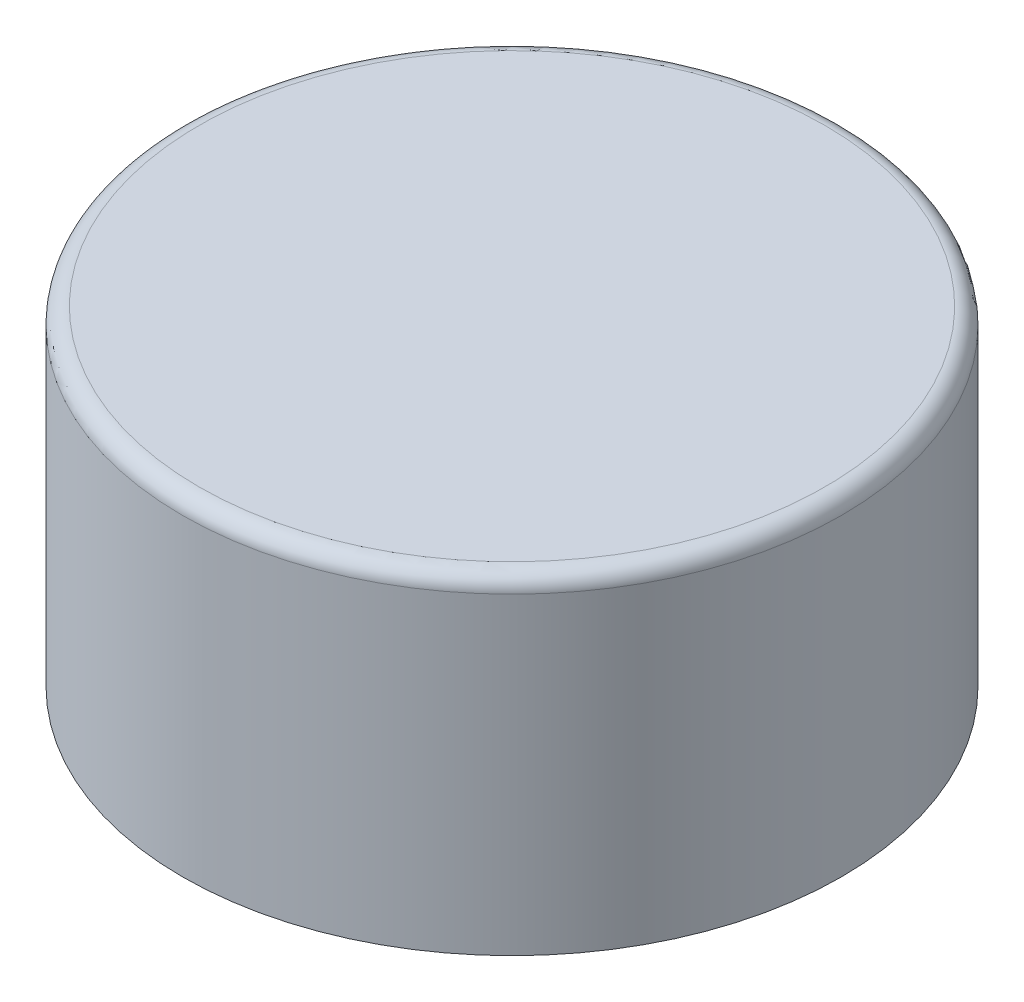
ISO-10303-21;
HEADER;
FILE_DESCRIPTION(('STEP AP214'),'2;1');
FILE_NAME('part.step','',(''),(''),'','','');
FILE_SCHEMA(('AUTOMOTIVE_DESIGN { 1 0 10303 214 1 1 1 1 }'));
ENDSEC;
DATA;
#1=APPLICATION_CONTEXT('core data for automotive mechanical design processes');
#2=APPLICATION_PROTOCOL_DEFINITION('international standard','automotive_design',2000,#1);
#3=PRODUCT_CONTEXT('',#1,'mechanical');
#4=PRODUCT('Part','Part','',(#3));
#5=PRODUCT_RELATED_PRODUCT_CATEGORY('part','',(#4));
#6=PRODUCT_DEFINITION_FORMATION('','',#4);
#7=PRODUCT_DEFINITION_CONTEXT('part definition',#1,'design');
#8=PRODUCT_DEFINITION('design','',#6,#7);
#9=PRODUCT_DEFINITION_SHAPE('','',#8);
#10=(LENGTH_UNIT() NAMED_UNIT(*) SI_UNIT(.MILLI.,.METRE.));
#11=(NAMED_UNIT(*) PLANE_ANGLE_UNIT() SI_UNIT($,.RADIAN.));
#12=(NAMED_UNIT(*) SI_UNIT($,.STERADIAN.) SOLID_ANGLE_UNIT());
#13=UNCERTAINTY_MEASURE_WITH_UNIT(LENGTH_MEASURE(1.E-05),#10,'distance_accuracy_value','');
#14=(GEOMETRIC_REPRESENTATION_CONTEXT(3) GLOBAL_UNCERTAINTY_ASSIGNED_CONTEXT((#13)) GLOBAL_UNIT_ASSIGNED_CONTEXT((#10,
#11,#12)) REPRESENTATION_CONTEXT('',''));
#15=CARTESIAN_POINT('',(0.,0.,0.));
#16=DIRECTION('',(0.,0.,1.));
#17=DIRECTION('',(1.,0.,0.));
#18=AXIS2_PLACEMENT_3D('',#15,#16,#17);
#19=CARTESIAN_POINT('',(0.,-20.,0.));
#20=DIRECTION('',(0.,1.,0.));
#21=DIRECTION('',(0.,0.,1.));
#22=AXIS2_PLACEMENT_3D('',#19,#20,#21);
#23=PLANE('',#22);
#24=CARTESIAN_POINT('',(0.,-20.,0.));
#25=DIRECTION('',(0.,1.,0.));
#26=DIRECTION('',(0.,0.,1.));
#27=AXIS2_PLACEMENT_3D('',#24,#25,#26);
#28=CIRCLE('',#27,40.);
#29=CARTESIAN_POINT('',(0.,-20.,40.));
#30=VERTEX_POINT('',#29);
#31=EDGE_CURVE('E68',#30,#30,#28,.T.);
#32=ORIENTED_EDGE('',*,*,#31,.F.);
#33=EDGE_LOOP('',(#32));
#34=FACE_BOUND('',#33,.T.);
#35=CARTESIAN_POINT('',(0.,-20.,0.));
#36=DIRECTION('',(0.,1.,0.));
#37=DIRECTION('',(0.,0.,1.));
#38=AXIS2_PLACEMENT_3D('',#35,#36,#37);
#39=CIRCLE('',#38,9.75);
#40=CARTESIAN_POINT('',(0.,-20.,-9.75));
#41=VERTEX_POINT('',#40);
#42=EDGE_CURVE('E12',#41,#41,#39,.T.);
#43=ORIENTED_EDGE('',*,*,#42,.T.);
#44=EDGE_LOOP('',(#43));
#45=FACE_BOUND('',#44,.T.);
#46=ADVANCED_FACE('F50',(#34,#45),#23,.F.);
#47=CARTESIAN_POINT('',(0.,20.,0.));
#48=DIRECTION('',(0.,-1.,0.));
#49=DIRECTION('',(0.,0.,-1.));
#50=AXIS2_PLACEMENT_3D('',#47,#48,#49);
#51=CYLINDRICAL_SURFACE('',#50,40.);
#52=CARTESIAN_POINT('',(0.,18.,0.));
#53=DIRECTION('',(0.,1.,0.));
#54=DIRECTION('',(0.,0.,1.));
#55=AXIS2_PLACEMENT_3D('',#52,#53,#54);
#56=CIRCLE('',#55,40.);
#57=CARTESIAN_POINT('',(0.,18.,40.));
#58=VERTEX_POINT('',#57);
#59=EDGE_CURVE('E81',#58,#58,#56,.F.);
#60=ORIENTED_EDGE('',*,*,#59,.T.);
#61=EDGE_LOOP('',(#60));
#62=FACE_BOUND('',#61,.T.);
#63=ORIENTED_EDGE('',*,*,#31,.T.);
#64=EDGE_LOOP('',(#63));
#65=FACE_BOUND('',#64,.T.);
#66=ADVANCED_FACE('F94',(#62,#65),#51,.T.);
#67=CARTESIAN_POINT('',(0.,20.,0.));
#68=DIRECTION('',(0.,1.,0.));
#69=DIRECTION('',(0.,0.,1.));
#70=AXIS2_PLACEMENT_3D('',#67,#68,#69);
#71=PLANE('',#70);
#72=CARTESIAN_POINT('',(0.,20.,0.));
#73=DIRECTION('',(0.,1.,0.));
#74=DIRECTION('',(0.,0.,1.));
#75=AXIS2_PLACEMENT_3D('',#72,#73,#74);
#76=CIRCLE('',#75,38.);
#77=CARTESIAN_POINT('',(0.,20.,38.));
#78=VERTEX_POINT('',#77);
#79=EDGE_CURVE('E72',#78,#78,#76,.T.);
#80=ORIENTED_EDGE('',*,*,#79,.T.);
#81=EDGE_LOOP('',(#80));
#82=FACE_BOUND('',#81,.T.);
#83=ADVANCED_FACE('F99',(#82),#71,.T.);
#84=CARTESIAN_POINT('',(0.,18.,0.));
#85=DIRECTION('',(0.,1.,0.));
#86=DIRECTION('',(0.,0.,1.));
#87=AXIS2_PLACEMENT_3D('',#84,#85,#86);
#88=TOROIDAL_SURFACE('',#87,38.,2.);
#89=ORIENTED_EDGE('',*,*,#59,.F.);
#90=EDGE_LOOP('',(#89));
#91=FACE_BOUND('',#90,.T.);
#92=ORIENTED_EDGE('',*,*,#79,.F.);
#93=EDGE_LOOP('',(#92));
#94=FACE_BOUND('',#93,.T.);
#95=ADVANCED_FACE('F52',(#91,#94),#88,.T.);
#96=CARTESIAN_POINT('',(0.,-20.,0.));
#97=DIRECTION('',(0.,-1.,0.));
#98=DIRECTION('',(0.,0.,-1.));
#99=AXIS2_PLACEMENT_3D('',#96,#97,#98);
#100=TOROIDAL_SURFACE('',#99,9.,0.750000000000001);
#101=CARTESIAN_POINT('',(0.,-20.,-9.));
#102=DIRECTION('',(1.,0.,0.));
#103=DIRECTION('',(0.,1.,0.));
#104=AXIS2_PLACEMENT_3D('',#101,#102,#103);
#105=CIRCLE('',#104,0.750000000000001);
#106=CARTESIAN_POINT('',(0.,-20.,-8.25));
#107=VERTEX_POINT('',#106);
#108=EDGE_CURVE('E65',#41,#107,#105,.T.);
#109=ORIENTED_EDGE('',*,*,#108,.T.);
#110=CARTESIAN_POINT('',(0.,-20.,0.));
#111=DIRECTION('',(0.,-1.,0.));
#112=DIRECTION('',(0.,0.,-1.));
#113=AXIS2_PLACEMENT_3D('',#110,#111,#112);
#114=CIRCLE('',#113,8.25);
#115=EDGE_CURVE('E58',#107,#107,#114,.T.);
#116=ORIENTED_EDGE('',*,*,#115,.F.);
#117=ORIENTED_EDGE('',*,*,#108,.F.);
#118=ORIENTED_EDGE('',*,*,#42,.F.);
#119=EDGE_LOOP('',(#109,#116,#117,#118));
#120=FACE_BOUND('',#119,.T.);
#121=ADVANCED_FACE('F66',(#120),#100,.F.);
#122=ORIENTED_EDGE('',*,*,#115,.T.);
#123=EDGE_LOOP('',(#122));
#124=FACE_BOUND('',#123,.T.);
#125=ADVANCED_FACE('F84',(#124),#23,.F.);
#126=CLOSED_SHELL('',(#46,#66,#83,#95,#121,#125));
#127=CARTESIAN_POINT('',(0.,1.,0.));
#128=DIRECTION('',(0.,1.,0.));
#129=DIRECTION('',(0.,0.,1.));
#130=AXIS2_PLACEMENT_3D('',#127,#128,#129);
#131=PLANE('',#130);
#132=CARTESIAN_POINT('',(0.,1.,0.));
#133=DIRECTION('',(0.,-1.,0.));
#134=DIRECTION('',(0.,0.,-1.));
#135=AXIS2_PLACEMENT_3D('',#132,#133,#134);
#136=CIRCLE('',#135,0.5);
#137=CARTESIAN_POINT('',(0.,1.,-0.5));
#138=VERTEX_POINT('',#137);
#139=EDGE_CURVE('E69',#138,#138,#136,.T.);
#140=ORIENTED_EDGE('',*,*,#139,.T.);
#141=EDGE_LOOP('',(#140));
#142=FACE_BOUND('',#141,.T.);
#143=ADVANCED_FACE('F133',(#142),#131,.F.);
#144=CARTESIAN_POINT('',(0.,0.,0.));
#145=DIRECTION('',(0.,-1.,0.));
#146=DIRECTION('',(0.,0.,-1.));
#147=AXIS2_PLACEMENT_3D('',#144,#145,#146);
#148=CYLINDRICAL_SURFACE('',#147,0.5);
#149=ORIENTED_EDGE('',*,*,#139,.F.);
#150=EDGE_LOOP('',(#149));
#151=FACE_BOUND('',#150,.T.);
#152=CARTESIAN_POINT('',(0.,0.,0.));
#153=DIRECTION('',(0.,-1.,0.));
#154=DIRECTION('',(0.,0.,-1.));
#155=AXIS2_PLACEMENT_3D('',#152,#153,#154);
#156=CIRCLE('',#155,0.5);
#157=CARTESIAN_POINT('',(0.,0.,-0.5));
#158=VERTEX_POINT('',#157);
#159=EDGE_CURVE('E75',#158,#158,#156,.T.);
#160=ORIENTED_EDGE('',*,*,#159,.T.);
#161=EDGE_LOOP('',(#160));
#162=FACE_BOUND('',#161,.T.);
#163=ADVANCED_FACE('F136',(#151,#162),#148,.F.);
#164=CARTESIAN_POINT('',(0.,0.,0.));
#165=DIRECTION('',(0.,-1.,0.));
#166=DIRECTION('',(0.,0.,-1.));
#167=AXIS2_PLACEMENT_3D('',#164,#165,#166);
#168=PLANE('',#167);
#169=ORIENTED_EDGE('',*,*,#159,.F.);
#170=EDGE_LOOP('',(#169));
#171=FACE_BOUND('',#170,.T.);
#172=ADVANCED_FACE('F147',(#171),#168,.F.);
#173=CLOSED_SHELL('',(#143,#163,#172));
#174=ORIENTED_CLOSED_SHELL('',*,#173,.T.);
#175=BREP_WITH_VOIDS('B2',#126,(#174));
#176=ADVANCED_BREP_SHAPE_REPRESENTATION('',(#18,#175),#14);
#177=SHAPE_DEFINITION_REPRESENTATION(#9,#176);
ENDSEC;
END-ISO-10303-21;
